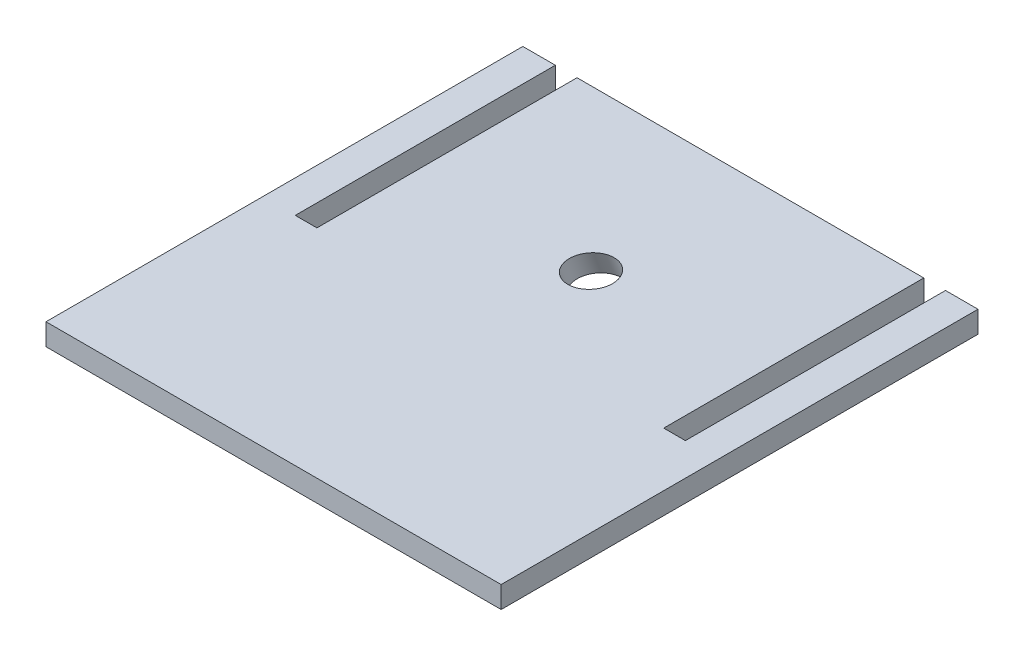
ISO-10303-21;
HEADER;
FILE_DESCRIPTION(('STEP AP214'),'2;1');
FILE_NAME('part.step','',(''),(''),'','','');
FILE_SCHEMA(('AUTOMOTIVE_DESIGN { 1 0 10303 214 1 1 1 1 }'));
ENDSEC;
DATA;
#1=APPLICATION_CONTEXT('core data for automotive mechanical design processes');
#2=APPLICATION_PROTOCOL_DEFINITION('international standard','automotive_design',2000,#1);
#3=PRODUCT_CONTEXT('',#1,'mechanical');
#4=PRODUCT('Part','Part','',(#3));
#5=PRODUCT_RELATED_PRODUCT_CATEGORY('part','',(#4));
#6=PRODUCT_DEFINITION_FORMATION('','',#4);
#7=PRODUCT_DEFINITION_CONTEXT('part definition',#1,'design');
#8=PRODUCT_DEFINITION('design','',#6,#7);
#9=PRODUCT_DEFINITION_SHAPE('','',#8);
#10=(LENGTH_UNIT() NAMED_UNIT(*) SI_UNIT(.MILLI.,.METRE.));
#11=(NAMED_UNIT(*) PLANE_ANGLE_UNIT() SI_UNIT($,.RADIAN.));
#12=(NAMED_UNIT(*) SI_UNIT($,.STERADIAN.) SOLID_ANGLE_UNIT());
#13=UNCERTAINTY_MEASURE_WITH_UNIT(LENGTH_MEASURE(1.E-05),#10,'distance_accuracy_value','');
#14=(GEOMETRIC_REPRESENTATION_CONTEXT(3) GLOBAL_UNCERTAINTY_ASSIGNED_CONTEXT((#13)) GLOBAL_UNIT_ASSIGNED_CONTEXT((#10,
#11,#12)) REPRESENTATION_CONTEXT('',''));
#15=CARTESIAN_POINT('',(0.,0.,0.));
#16=DIRECTION('',(0.,0.,1.));
#17=DIRECTION('',(1.,0.,0.));
#18=AXIS2_PLACEMENT_3D('',#15,#16,#17);
#19=CARTESIAN_POINT('',(-165.1,6.35,-139.7));
#20=DIRECTION('',(0.,0.,1.));
#21=DIRECTION('',(1.,0.,0.));
#22=AXIS2_PLACEMENT_3D('',#19,#20,#21);
#23=PLANE('',#22);
#24=DIRECTION('',(-1.,0.,0.));
#25=VECTOR('',#24,1.);
#26=CARTESIAN_POINT('',(-165.1,-6.35,-139.7));
#27=LINE('',#26,#25);
#28=CARTESIAN_POINT('',(-114.3,-6.35,-139.7));
#29=VERTEX_POINT('',#28);
#30=CARTESIAN_POINT('',(-133.35,-6.35,-139.7));
#31=VERTEX_POINT('',#30);
#32=EDGE_CURVE('E129',#29,#31,#27,.T.);
#33=ORIENTED_EDGE('',*,*,#32,.T.);
#34=DIRECTION('',(0.,1.,0.));
#35=VECTOR('',#34,1.);
#36=CARTESIAN_POINT('',(-133.35,-6.35,-139.7));
#37=LINE('',#36,#35);
#38=CARTESIAN_POINT('',(-133.35,6.35,-139.7));
#39=VERTEX_POINT('',#38);
#40=EDGE_CURVE('E119',#31,#39,#37,.T.);
#41=ORIENTED_EDGE('',*,*,#40,.T.);
#42=DIRECTION('',(-1.,0.,0.));
#43=VECTOR('',#42,1.);
#44=CARTESIAN_POINT('',(-165.1,6.35,-139.7));
#45=LINE('',#44,#43);
#46=CARTESIAN_POINT('',(-114.3,6.35,-139.7));
#47=VERTEX_POINT('',#46);
#48=EDGE_CURVE('E194',#47,#39,#45,.T.);
#49=ORIENTED_EDGE('',*,*,#48,.F.);
#50=DIRECTION('',(0.,1.,0.));
#51=VECTOR('',#50,1.);
#52=CARTESIAN_POINT('',(-114.3,-6.35,-139.7));
#53=LINE('',#52,#51);
#54=EDGE_CURVE('E142',#29,#47,#53,.T.);
#55=ORIENTED_EDGE('',*,*,#54,.F.);
#56=EDGE_LOOP('',(#33,#41,#49,#55));
#57=FACE_BOUND('',#56,.T.);
#58=ADVANCED_FACE('F37',(#57),#23,.F.);
#59=CARTESIAN_POINT('',(133.35,6.35,-139.7));
#60=VERTEX_POINT('',#59);
#61=CARTESIAN_POINT('',(114.3,6.35,-139.7));
#62=VERTEX_POINT('',#61);
#63=EDGE_CURVE('E203',#60,#62,#45,.T.);
#64=ORIENTED_EDGE('',*,*,#63,.F.);
#65=DIRECTION('',(0.,1.,0.));
#66=VECTOR('',#65,1.);
#67=CARTESIAN_POINT('',(133.35,-6.35,-139.7));
#68=LINE('',#67,#66);
#69=CARTESIAN_POINT('',(133.35,-6.35,-139.7));
#70=VERTEX_POINT('',#69);
#71=EDGE_CURVE('E190',#70,#60,#68,.T.);
#72=ORIENTED_EDGE('',*,*,#71,.F.);
#73=CARTESIAN_POINT('',(114.3,-6.35,-139.7));
#74=VERTEX_POINT('',#73);
#75=EDGE_CURVE('E128',#70,#74,#27,.T.);
#76=ORIENTED_EDGE('',*,*,#75,.T.);
#77=DIRECTION('',(0.,1.,0.));
#78=VECTOR('',#77,1.);
#79=CARTESIAN_POINT('',(114.3,-6.35,-139.7));
#80=LINE('',#79,#78);
#81=EDGE_CURVE('E149',#74,#62,#80,.T.);
#82=ORIENTED_EDGE('',*,*,#81,.T.);
#83=EDGE_LOOP('',(#64,#72,#76,#82));
#84=FACE_BOUND('',#83,.T.);
#85=ADVANCED_FACE('F207',(#84),#23,.F.);
#86=CARTESIAN_POINT('',(101.6,-6.35,-139.7));
#87=VERTEX_POINT('',#86);
#88=CARTESIAN_POINT('',(-101.6,-6.35,-139.7));
#89=VERTEX_POINT('',#88);
#90=EDGE_CURVE('E144',#87,#89,#27,.T.);
#91=ORIENTED_EDGE('',*,*,#90,.T.);
#92=DIRECTION('',(0.,1.,0.));
#93=VECTOR('',#92,1.);
#94=CARTESIAN_POINT('',(-101.6,-6.35,-139.7));
#95=LINE('',#94,#93);
#96=CARTESIAN_POINT('',(-101.6,6.35,-139.7));
#97=VERTEX_POINT('',#96);
#98=EDGE_CURVE('E148',#89,#97,#95,.T.);
#99=ORIENTED_EDGE('',*,*,#98,.T.);
#100=CARTESIAN_POINT('',(101.6,6.35,-139.7));
#101=VERTEX_POINT('',#100);
#102=EDGE_CURVE('E208',#101,#97,#45,.T.);
#103=ORIENTED_EDGE('',*,*,#102,.F.);
#104=DIRECTION('',(0.,1.,0.));
#105=VECTOR('',#104,1.);
#106=CARTESIAN_POINT('',(101.6,-6.35,-139.7));
#107=LINE('',#106,#105);
#108=EDGE_CURVE('E159',#87,#101,#107,.T.);
#109=ORIENTED_EDGE('',*,*,#108,.F.);
#110=EDGE_LOOP('',(#91,#99,#103,#109));
#111=FACE_BOUND('',#110,.T.);
#112=ADVANCED_FACE('F226',(#111),#23,.F.);
#113=CARTESIAN_POINT('',(-165.1,6.35,139.7));
#114=DIRECTION('',(0.,0.,-1.));
#115=DIRECTION('',(-1.,0.,0.));
#116=AXIS2_PLACEMENT_3D('',#113,#114,#115);
#117=PLANE('',#116);
#118=DIRECTION('',(1.,0.,0.));
#119=VECTOR('',#118,1.);
#120=CARTESIAN_POINT('',(-165.1,6.35,139.7));
#121=LINE('',#120,#119);
#122=CARTESIAN_POINT('',(-133.35,6.35,139.7));
#123=VERTEX_POINT('',#122);
#124=CARTESIAN_POINT('',(133.35,6.35,139.7));
#125=VERTEX_POINT('',#124);
#126=EDGE_CURVE('E206',#123,#125,#121,.T.);
#127=ORIENTED_EDGE('',*,*,#126,.F.);
#128=DIRECTION('',(0.,1.,0.));
#129=VECTOR('',#128,1.);
#130=CARTESIAN_POINT('',(-133.35,-6.35,139.7));
#131=LINE('',#130,#129);
#132=CARTESIAN_POINT('',(-133.35,-6.35,139.7));
#133=VERTEX_POINT('',#132);
#134=EDGE_CURVE('E46',#133,#123,#131,.T.);
#135=ORIENTED_EDGE('',*,*,#134,.F.);
#136=DIRECTION('',(1.,0.,0.));
#137=VECTOR('',#136,1.);
#138=CARTESIAN_POINT('',(-165.1,-6.35,139.7));
#139=LINE('',#138,#137);
#140=CARTESIAN_POINT('',(133.35,-6.35,139.7));
#141=VERTEX_POINT('',#140);
#142=EDGE_CURVE('E138',#133,#141,#139,.T.);
#143=ORIENTED_EDGE('',*,*,#142,.T.);
#144=DIRECTION('',(0.,1.,0.));
#145=VECTOR('',#144,1.);
#146=CARTESIAN_POINT('',(133.35,-6.35,139.7));
#147=LINE('',#146,#145);
#148=EDGE_CURVE('E191',#141,#125,#147,.T.);
#149=ORIENTED_EDGE('',*,*,#148,.T.);
#150=EDGE_LOOP('',(#127,#135,#143,#149));
#151=FACE_BOUND('',#150,.T.);
#152=ADVANCED_FACE('F269',(#151),#117,.F.);
#153=CARTESIAN_POINT('',(0.,6.35,0.));
#154=DIRECTION('',(0.,-1.,0.));
#155=DIRECTION('',(0.,0.,-1.));
#156=AXIS2_PLACEMENT_3D('',#153,#154,#155);
#157=PLANE('',#156);
#158=CARTESIAN_POINT('',(0.577885440567185,6.35,-45.6972730911315));
#159=DIRECTION('',(0.,-1.,0.));
#160=DIRECTION('',(-0.0211224465515139,0.,-0.999776896238195));
#161=AXIS2_PLACEMENT_3D('',#158,#159,#160);
#162=ELLIPSE('',#161,13.5685983777434,12.7);
#163=CARTESIAN_POINT('',(0.291283446554342,6.35,-59.2628442635344));
#164=VERTEX_POINT('',#163);
#165=EDGE_CURVE('E11',#164,#164,#162,.F.);
#166=ORIENTED_EDGE('',*,*,#165,.F.);
#167=EDGE_LOOP('',(#166));
#168=FACE_BOUND('',#167,.T.);
#169=ORIENTED_EDGE('',*,*,#48,.T.);
#170=DIRECTION('',(0.,0.,-1.));
#171=VECTOR('',#170,1.);
#172=CARTESIAN_POINT('',(-133.35,6.35,-139.7));
#173=LINE('',#172,#171);
#174=EDGE_CURVE('E123',#123,#39,#173,.T.);
#175=ORIENTED_EDGE('',*,*,#174,.F.);
#176=ORIENTED_EDGE('',*,*,#126,.T.);
#177=DIRECTION('',(0.,0.,1.));
#178=VECTOR('',#177,1.);
#179=CARTESIAN_POINT('',(133.35,6.35,-139.7));
#180=LINE('',#179,#178);
#181=EDGE_CURVE('E163',#60,#125,#180,.T.);
#182=ORIENTED_EDGE('',*,*,#181,.F.);
#183=ORIENTED_EDGE('',*,*,#63,.T.);
#184=DIRECTION('',(0.,0.,-1.));
#185=VECTOR('',#184,1.);
#186=CARTESIAN_POINT('',(114.3,6.35,-139.7));
#187=LINE('',#186,#185);
#188=CARTESIAN_POINT('',(114.3,6.35,12.7));
#189=VERTEX_POINT('',#188);
#190=EDGE_CURVE('E187',#189,#62,#187,.T.);
#191=ORIENTED_EDGE('',*,*,#190,.F.);
#192=DIRECTION('',(1.,0.,0.));
#193=VECTOR('',#192,1.);
#194=CARTESIAN_POINT('',(114.3,6.35,12.7));
#195=LINE('',#194,#193);
#196=CARTESIAN_POINT('',(101.6,6.35,12.7));
#197=VERTEX_POINT('',#196);
#198=EDGE_CURVE('E233',#197,#189,#195,.T.);
#199=ORIENTED_EDGE('',*,*,#198,.F.);
#200=DIRECTION('',(0.,0.,1.));
#201=VECTOR('',#200,1.);
#202=CARTESIAN_POINT('',(101.6,6.35,-139.7));
#203=LINE('',#202,#201);
#204=EDGE_CURVE('E231',#101,#197,#203,.T.);
#205=ORIENTED_EDGE('',*,*,#204,.F.);
#206=ORIENTED_EDGE('',*,*,#102,.T.);
#207=DIRECTION('',(0.,0.,-1.));
#208=VECTOR('',#207,1.);
#209=CARTESIAN_POINT('',(-101.6,6.35,-139.7));
#210=LINE('',#209,#208);
#211=CARTESIAN_POINT('',(-101.6,6.35,12.7));
#212=VERTEX_POINT('',#211);
#213=EDGE_CURVE('E167',#212,#97,#210,.T.);
#214=ORIENTED_EDGE('',*,*,#213,.F.);
#215=DIRECTION('',(1.,0.,0.));
#216=VECTOR('',#215,1.);
#217=CARTESIAN_POINT('',(-114.3,6.35,12.7));
#218=LINE('',#217,#216);
#219=CARTESIAN_POINT('',(-114.3,6.35,12.7));
#220=VERTEX_POINT('',#219);
#221=EDGE_CURVE('E164',#220,#212,#218,.T.);
#222=ORIENTED_EDGE('',*,*,#221,.F.);
#223=DIRECTION('',(0.,0.,1.));
#224=VECTOR('',#223,1.);
#225=CARTESIAN_POINT('',(-114.3,6.35,-139.7));
#226=LINE('',#225,#224);
#227=EDGE_CURVE('E171',#47,#220,#226,.T.);
#228=ORIENTED_EDGE('',*,*,#227,.F.);
#229=EDGE_LOOP('',(#169,#175,#176,#182,#183,#191,#199,#205,#206,#214,#222,#228));
#230=FACE_BOUND('',#229,.T.);
#231=ADVANCED_FACE('F39',(#168,#230),#157,.F.);
#232=CARTESIAN_POINT('',(0.,-6.35,0.));
#233=DIRECTION('',(0.,-1.,0.));
#234=DIRECTION('',(0.,0.,-1.));
#235=AXIS2_PLACEMENT_3D('',#232,#233,#234);
#236=PLANE('',#235);
#237=CARTESIAN_POINT('',(0.476989852232747,-6.35,-50.4729072916073));
#238=DIRECTION('',(0.,-1.,0.));
#239=DIRECTION('',(-0.0211224465515139,0.,-0.999776896238195));
#240=AXIS2_PLACEMENT_3D('',#237,#238,#239);
#241=ELLIPSE('',#240,13.5685983777434,12.7);
#242=CARTESIAN_POINT('',(0.190387858219904,-6.35,-64.0384784640101));
#243=VERTEX_POINT('',#242);
#244=EDGE_CURVE('E140',#243,#243,#241,.F.);
#245=ORIENTED_EDGE('',*,*,#244,.T.);
#246=EDGE_LOOP('',(#245));
#247=FACE_BOUND('',#246,.T.);
#248=DIRECTION('',(0.,0.,-1.));
#249=VECTOR('',#248,1.);
#250=CARTESIAN_POINT('',(-133.35,-6.35,-139.7));
#251=LINE('',#250,#249);
#252=EDGE_CURVE('E122',#133,#31,#251,.T.);
#253=ORIENTED_EDGE('',*,*,#252,.T.);
#254=ORIENTED_EDGE('',*,*,#32,.F.);
#255=DIRECTION('',(0.,0.,1.));
#256=VECTOR('',#255,1.);
#257=CARTESIAN_POINT('',(-114.3,-6.35,-139.7));
#258=LINE('',#257,#256);
#259=CARTESIAN_POINT('',(-114.3,-6.35,12.7));
#260=VERTEX_POINT('',#259);
#261=EDGE_CURVE('E139',#29,#260,#258,.T.);
#262=ORIENTED_EDGE('',*,*,#261,.T.);
#263=DIRECTION('',(1.,0.,0.));
#264=VECTOR('',#263,1.);
#265=CARTESIAN_POINT('',(-114.3,-6.35,12.7));
#266=LINE('',#265,#264);
#267=CARTESIAN_POINT('',(-101.6,-6.35,12.7));
#268=VERTEX_POINT('',#267);
#269=EDGE_CURVE('E181',#260,#268,#266,.T.);
#270=ORIENTED_EDGE('',*,*,#269,.T.);
#271=DIRECTION('',(0.,0.,-1.));
#272=VECTOR('',#271,1.);
#273=CARTESIAN_POINT('',(-101.6,-6.35,-139.7));
#274=LINE('',#273,#272);
#275=EDGE_CURVE('E177',#268,#89,#274,.T.);
#276=ORIENTED_EDGE('',*,*,#275,.T.);
#277=ORIENTED_EDGE('',*,*,#90,.F.);
#278=DIRECTION('',(0.,0.,1.));
#279=VECTOR('',#278,1.);
#280=CARTESIAN_POINT('',(101.6,-6.35,-139.7));
#281=LINE('',#280,#279);
#282=CARTESIAN_POINT('',(101.6,-6.35,12.7));
#283=VERTEX_POINT('',#282);
#284=EDGE_CURVE('E180',#87,#283,#281,.T.);
#285=ORIENTED_EDGE('',*,*,#284,.T.);
#286=DIRECTION('',(1.,0.,0.));
#287=VECTOR('',#286,1.);
#288=CARTESIAN_POINT('',(114.3,-6.35,12.7));
#289=LINE('',#288,#287);
#290=CARTESIAN_POINT('',(114.3,-6.35,12.7));
#291=VERTEX_POINT('',#290);
#292=EDGE_CURVE('E249',#283,#291,#289,.T.);
#293=ORIENTED_EDGE('',*,*,#292,.T.);
#294=DIRECTION('',(0.,0.,-1.));
#295=VECTOR('',#294,1.);
#296=CARTESIAN_POINT('',(114.3,-6.35,-139.7));
#297=LINE('',#296,#295);
#298=EDGE_CURVE('E188',#291,#74,#297,.T.);
#299=ORIENTED_EDGE('',*,*,#298,.T.);
#300=ORIENTED_EDGE('',*,*,#75,.F.);
#301=DIRECTION('',(0.,0.,1.));
#302=VECTOR('',#301,1.);
#303=CARTESIAN_POINT('',(133.35,-6.35,-139.7));
#304=LINE('',#303,#302);
#305=EDGE_CURVE('E185',#70,#141,#304,.T.);
#306=ORIENTED_EDGE('',*,*,#305,.T.);
#307=ORIENTED_EDGE('',*,*,#142,.F.);
#308=EDGE_LOOP('',(#253,#254,#262,#270,#276,#277,#285,#293,#299,#300,#306,#307));
#309=FACE_BOUND('',#308,.T.);
#310=ADVANCED_FACE('F134',(#247,#309),#236,.T.);
#311=CARTESIAN_POINT('',(114.3,-6.35,-139.7));
#312=DIRECTION('',(1.,0.,0.));
#313=DIRECTION('',(0.,0.,-1.));
#314=AXIS2_PLACEMENT_3D('',#311,#312,#313);
#315=PLANE('',#314);
#316=ORIENTED_EDGE('',*,*,#190,.T.);
#317=ORIENTED_EDGE('',*,*,#81,.F.);
#318=ORIENTED_EDGE('',*,*,#298,.F.);
#319=DIRECTION('',(0.,1.,0.));
#320=VECTOR('',#319,1.);
#321=CARTESIAN_POINT('',(114.3,-6.35,12.7));
#322=LINE('',#321,#320);
#323=EDGE_CURVE('E242',#291,#189,#322,.T.);
#324=ORIENTED_EDGE('',*,*,#323,.T.);
#325=EDGE_LOOP('',(#316,#317,#318,#324));
#326=FACE_BOUND('',#325,.T.);
#327=ADVANCED_FACE('F245',(#326),#315,.F.);
#328=CARTESIAN_POINT('',(114.3,-6.35,12.7));
#329=DIRECTION('',(0.,0.,1.));
#330=DIRECTION('',(1.,0.,0.));
#331=AXIS2_PLACEMENT_3D('',#328,#329,#330);
#332=PLANE('',#331);
#333=ORIENTED_EDGE('',*,*,#198,.T.);
#334=ORIENTED_EDGE('',*,*,#323,.F.);
#335=ORIENTED_EDGE('',*,*,#292,.F.);
#336=DIRECTION('',(0.,1.,0.));
#337=VECTOR('',#336,1.);
#338=CARTESIAN_POINT('',(101.6,-6.35,12.7));
#339=LINE('',#338,#337);
#340=EDGE_CURVE('E236',#283,#197,#339,.T.);
#341=ORIENTED_EDGE('',*,*,#340,.T.);
#342=EDGE_LOOP('',(#333,#334,#335,#341));
#343=FACE_BOUND('',#342,.T.);
#344=ADVANCED_FACE('F253',(#343),#332,.F.);
#345=CARTESIAN_POINT('',(101.6,-6.35,-139.7));
#346=DIRECTION('',(-1.,0.,0.));
#347=DIRECTION('',(0.,0.,1.));
#348=AXIS2_PLACEMENT_3D('',#345,#346,#347);
#349=PLANE('',#348);
#350=ORIENTED_EDGE('',*,*,#204,.T.);
#351=ORIENTED_EDGE('',*,*,#340,.F.);
#352=ORIENTED_EDGE('',*,*,#284,.F.);
#353=ORIENTED_EDGE('',*,*,#108,.T.);
#354=EDGE_LOOP('',(#350,#351,#352,#353));
#355=FACE_BOUND('',#354,.T.);
#356=ADVANCED_FACE('F251',(#355),#349,.F.);
#357=CARTESIAN_POINT('',(-114.3,-6.35,-139.7));
#358=DIRECTION('',(-1.,0.,0.));
#359=DIRECTION('',(0.,0.,1.));
#360=AXIS2_PLACEMENT_3D('',#357,#358,#359);
#361=PLANE('',#360);
#362=ORIENTED_EDGE('',*,*,#227,.T.);
#363=DIRECTION('',(0.,1.,0.));
#364=VECTOR('',#363,1.);
#365=CARTESIAN_POINT('',(-114.3,-6.35,12.7));
#366=LINE('',#365,#364);
#367=EDGE_CURVE('E161',#260,#220,#366,.T.);
#368=ORIENTED_EDGE('',*,*,#367,.F.);
#369=ORIENTED_EDGE('',*,*,#261,.F.);
#370=ORIENTED_EDGE('',*,*,#54,.T.);
#371=EDGE_LOOP('',(#362,#368,#369,#370));
#372=FACE_BOUND('',#371,.T.);
#373=ADVANCED_FACE('F216',(#372),#361,.F.);
#374=CARTESIAN_POINT('',(-101.6,-6.35,-139.7));
#375=DIRECTION('',(1.,0.,0.));
#376=DIRECTION('',(0.,0.,-1.));
#377=AXIS2_PLACEMENT_3D('',#374,#375,#376);
#378=PLANE('',#377);
#379=ORIENTED_EDGE('',*,*,#213,.T.);
#380=ORIENTED_EDGE('',*,*,#98,.F.);
#381=ORIENTED_EDGE('',*,*,#275,.F.);
#382=DIRECTION('',(0.,1.,0.));
#383=VECTOR('',#382,1.);
#384=CARTESIAN_POINT('',(-101.6,-6.35,12.7));
#385=LINE('',#384,#383);
#386=EDGE_CURVE('E165',#268,#212,#385,.T.);
#387=ORIENTED_EDGE('',*,*,#386,.T.);
#388=EDGE_LOOP('',(#379,#380,#381,#387));
#389=FACE_BOUND('',#388,.T.);
#390=ADVANCED_FACE('F223',(#389),#378,.F.);
#391=CARTESIAN_POINT('',(-114.3,-6.35,12.7));
#392=DIRECTION('',(0.,0.,1.));
#393=DIRECTION('',(1.,0.,0.));
#394=AXIS2_PLACEMENT_3D('',#391,#392,#393);
#395=PLANE('',#394);
#396=ORIENTED_EDGE('',*,*,#221,.T.);
#397=ORIENTED_EDGE('',*,*,#386,.F.);
#398=ORIENTED_EDGE('',*,*,#269,.F.);
#399=ORIENTED_EDGE('',*,*,#367,.T.);
#400=EDGE_LOOP('',(#396,#397,#398,#399));
#401=FACE_BOUND('',#400,.T.);
#402=ADVANCED_FACE('F221',(#401),#395,.F.);
#403=CARTESIAN_POINT('',(133.35,-6.35,-139.7));
#404=DIRECTION('',(-1.,0.,0.));
#405=DIRECTION('',(0.,0.,1.));
#406=AXIS2_PLACEMENT_3D('',#403,#404,#405);
#407=PLANE('',#406);
#408=ORIENTED_EDGE('',*,*,#181,.T.);
#409=ORIENTED_EDGE('',*,*,#148,.F.);
#410=ORIENTED_EDGE('',*,*,#305,.F.);
#411=ORIENTED_EDGE('',*,*,#71,.T.);
#412=EDGE_LOOP('',(#408,#409,#410,#411));
#413=FACE_BOUND('',#412,.T.);
#414=ADVANCED_FACE('F199',(#413),#407,.F.);
#415=CARTESIAN_POINT('',(-133.35,-6.35,-139.7));
#416=DIRECTION('',(1.,0.,0.));
#417=DIRECTION('',(0.,0.,-1.));
#418=AXIS2_PLACEMENT_3D('',#415,#416,#417);
#419=PLANE('',#418);
#420=ORIENTED_EDGE('',*,*,#174,.T.);
#421=ORIENTED_EDGE('',*,*,#40,.F.);
#422=ORIENTED_EDGE('',*,*,#252,.F.);
#423=ORIENTED_EDGE('',*,*,#134,.T.);
#424=EDGE_LOOP('',(#420,#421,#422,#423));
#425=FACE_BOUND('',#424,.T.);
#426=ADVANCED_FACE('F121',(#425),#419,.F.);
#427=CARTESIAN_POINT('',(0.80308394695594,34.6963437633874,-35.0380787025587));
#428=DIRECTION('',(-0.0074359624719925,-0.935984664475876,-0.351962234235575));
#429=DIRECTION('',(0.,-0.35197196525769,0.936010542500799));
#430=AXIS2_PLACEMENT_3D('',#427,#428,#429);
#431=CYLINDRICAL_SURFACE('',#430,12.7);
#432=ORIENTED_EDGE('',*,*,#244,.F.);
#433=EDGE_LOOP('',(#432));
#434=FACE_BOUND('',#433,.T.);
#435=ORIENTED_EDGE('',*,*,#165,.T.);
#436=EDGE_LOOP('',(#435));
#437=FACE_BOUND('',#436,.T.);
#438=ADVANCED_FACE('F283',(#434,#437),#431,.F.);
#439=CLOSED_SHELL('',(#58,#85,#112,#152,#231,#310,#327,#344,#356,#373,#390,#402,#414,#426,#438));
#440=MANIFOLD_SOLID_BREP('B2',#439);
#441=ADVANCED_BREP_SHAPE_REPRESENTATION('',(#18,#440),#14);
#442=SHAPE_DEFINITION_REPRESENTATION(#9,#441);
ENDSEC;
END-ISO-10303-21;
